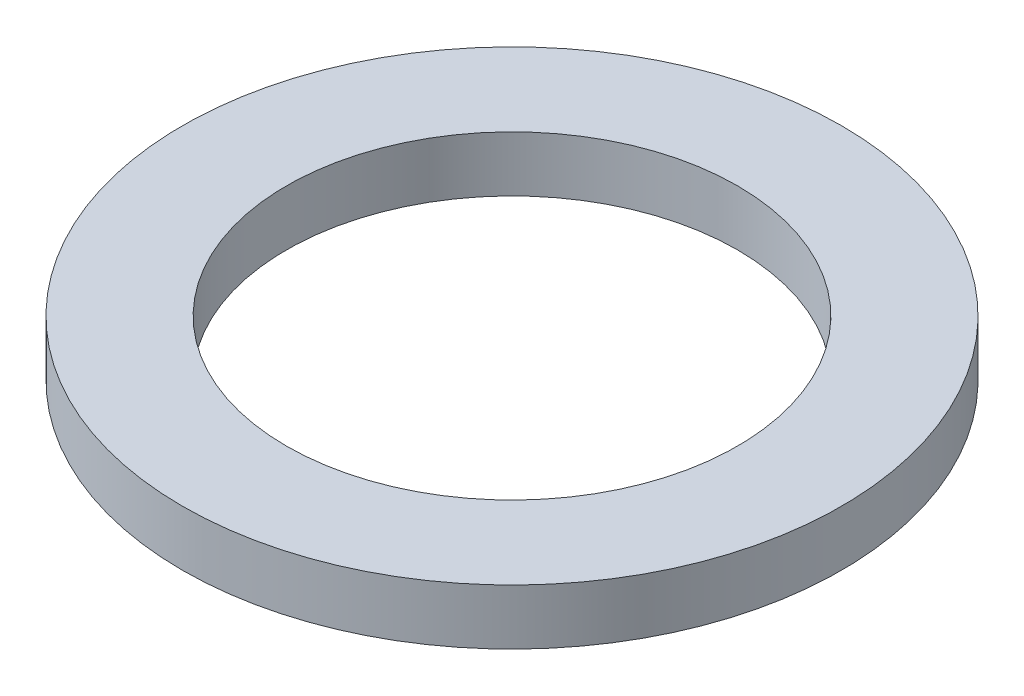
ISO-10303-21;
HEADER;
FILE_DESCRIPTION(('STEP AP214'),'2;1');
FILE_NAME('part.step','',(''),(''),'','','');
FILE_SCHEMA(('AUTOMOTIVE_DESIGN { 1 0 10303 214 1 1 1 1 }'));
ENDSEC;
DATA;
#1=APPLICATION_CONTEXT('core data for automotive mechanical design processes');
#2=APPLICATION_PROTOCOL_DEFINITION('international standard','automotive_design',2000,#1);
#3=PRODUCT_CONTEXT('',#1,'mechanical');
#4=PRODUCT('Part','Part','',(#3));
#5=PRODUCT_RELATED_PRODUCT_CATEGORY('part','',(#4));
#6=PRODUCT_DEFINITION_FORMATION('','',#4);
#7=PRODUCT_DEFINITION_CONTEXT('part definition',#1,'design');
#8=PRODUCT_DEFINITION('design','',#6,#7);
#9=PRODUCT_DEFINITION_SHAPE('','',#8);
#10=(LENGTH_UNIT() NAMED_UNIT(*) SI_UNIT(.MILLI.,.METRE.));
#11=(NAMED_UNIT(*) PLANE_ANGLE_UNIT() SI_UNIT($,.RADIAN.));
#12=(NAMED_UNIT(*) SI_UNIT($,.STERADIAN.) SOLID_ANGLE_UNIT());
#13=UNCERTAINTY_MEASURE_WITH_UNIT(LENGTH_MEASURE(1.E-05),#10,'distance_accuracy_value','');
#14=(GEOMETRIC_REPRESENTATION_CONTEXT(3) GLOBAL_UNCERTAINTY_ASSIGNED_CONTEXT((#13)) GLOBAL_UNIT_ASSIGNED_CONTEXT((#10,
#11,#12)) REPRESENTATION_CONTEXT('',''));
#15=CARTESIAN_POINT('',(0.,0.,0.));
#16=DIRECTION('',(0.,0.,1.));
#17=DIRECTION('',(1.,0.,0.));
#18=AXIS2_PLACEMENT_3D('',#15,#16,#17);
#19=CARTESIAN_POINT('',(0.,8.,0.));
#20=DIRECTION('',(0.,-1.,0.));
#21=DIRECTION('',(0.,0.,-1.));
#22=AXIS2_PLACEMENT_3D('',#19,#20,#21);
#23=CYLINDRICAL_SURFACE('',#22,47.5);
#24=CARTESIAN_POINT('',(0.,8.,0.));
#25=DIRECTION('',(0.,1.,0.));
#26=DIRECTION('',(0.,0.,1.));
#27=AXIS2_PLACEMENT_3D('',#24,#25,#26);
#28=CIRCLE('',#27,47.5);
#29=CARTESIAN_POINT('',(0.,8.,47.5));
#30=VERTEX_POINT('',#29);
#31=EDGE_CURVE('E10',#30,#30,#28,.T.);
#32=ORIENTED_EDGE('',*,*,#31,.F.);
#33=EDGE_LOOP('',(#32));
#34=FACE_BOUND('',#33,.T.);
#35=CARTESIAN_POINT('',(0.,0.,0.));
#36=DIRECTION('',(0.,1.,0.));
#37=DIRECTION('',(0.,0.,1.));
#38=AXIS2_PLACEMENT_3D('',#35,#36,#37);
#39=CIRCLE('',#38,47.5);
#40=CARTESIAN_POINT('',(0.,0.,47.5));
#41=VERTEX_POINT('',#40);
#42=EDGE_CURVE('E37',#41,#41,#39,.T.);
#43=ORIENTED_EDGE('',*,*,#42,.T.);
#44=EDGE_LOOP('',(#43));
#45=FACE_BOUND('',#44,.T.);
#46=ADVANCED_FACE('F40',(#34,#45),#23,.T.);
#47=CARTESIAN_POINT('',(0.,8.,0.));
#48=DIRECTION('',(0.,1.,0.));
#49=DIRECTION('',(0.,0.,1.));
#50=AXIS2_PLACEMENT_3D('',#47,#48,#49);
#51=PLANE('',#50);
#52=CARTESIAN_POINT('',(0.,8.,0.));
#53=DIRECTION('',(0.,1.,0.));
#54=DIRECTION('',(0.,0.,1.));
#55=AXIS2_PLACEMENT_3D('',#52,#53,#54);
#56=CIRCLE('',#55,32.5);
#57=CARTESIAN_POINT('',(0.,8.,32.5));
#58=VERTEX_POINT('',#57);
#59=EDGE_CURVE('E50',#58,#58,#56,.T.);
#60=ORIENTED_EDGE('',*,*,#59,.F.);
#61=EDGE_LOOP('',(#60));
#62=FACE_BOUND('',#61,.T.);
#63=ORIENTED_EDGE('',*,*,#31,.T.);
#64=EDGE_LOOP('',(#63));
#65=FACE_BOUND('',#64,.T.);
#66=ADVANCED_FACE('F59',(#62,#65),#51,.T.);
#67=CARTESIAN_POINT('',(0.,0.,0.));
#68=DIRECTION('',(0.,1.,0.));
#69=DIRECTION('',(0.,0.,1.));
#70=AXIS2_PLACEMENT_3D('',#67,#68,#69);
#71=PLANE('',#70);
#72=CARTESIAN_POINT('',(0.,0.,0.));
#73=DIRECTION('',(0.,1.,0.));
#74=DIRECTION('',(0.,0.,1.));
#75=AXIS2_PLACEMENT_3D('',#72,#73,#74);
#76=CIRCLE('',#75,32.5);
#77=CARTESIAN_POINT('',(0.,0.,32.5));
#78=VERTEX_POINT('',#77);
#79=EDGE_CURVE('E47',#78,#78,#76,.T.);
#80=ORIENTED_EDGE('',*,*,#79,.T.);
#81=EDGE_LOOP('',(#80));
#82=FACE_BOUND('',#81,.T.);
#83=ORIENTED_EDGE('',*,*,#42,.F.);
#84=EDGE_LOOP('',(#83));
#85=FACE_BOUND('',#84,.T.);
#86=ADVANCED_FACE('F58',(#82,#85),#71,.F.);
#87=CARTESIAN_POINT('',(0.,8.,0.));
#88=DIRECTION('',(0.,-1.,0.));
#89=DIRECTION('',(0.,0.,-1.));
#90=AXIS2_PLACEMENT_3D('',#87,#88,#89);
#91=CYLINDRICAL_SURFACE('',#90,32.5);
#92=ORIENTED_EDGE('',*,*,#59,.T.);
#93=EDGE_LOOP('',(#92));
#94=FACE_BOUND('',#93,.T.);
#95=ORIENTED_EDGE('',*,*,#79,.F.);
#96=EDGE_LOOP('',(#95));
#97=FACE_BOUND('',#96,.T.);
#98=ADVANCED_FACE('F54',(#94,#97),#91,.F.);
#99=CLOSED_SHELL('',(#46,#66,#86,#98));
#100=MANIFOLD_SOLID_BREP('B2',#99);
#101=ADVANCED_BREP_SHAPE_REPRESENTATION('',(#18,#100),#14);
#102=SHAPE_DEFINITION_REPRESENTATION(#9,#101);
ENDSEC;
END-ISO-10303-21;
